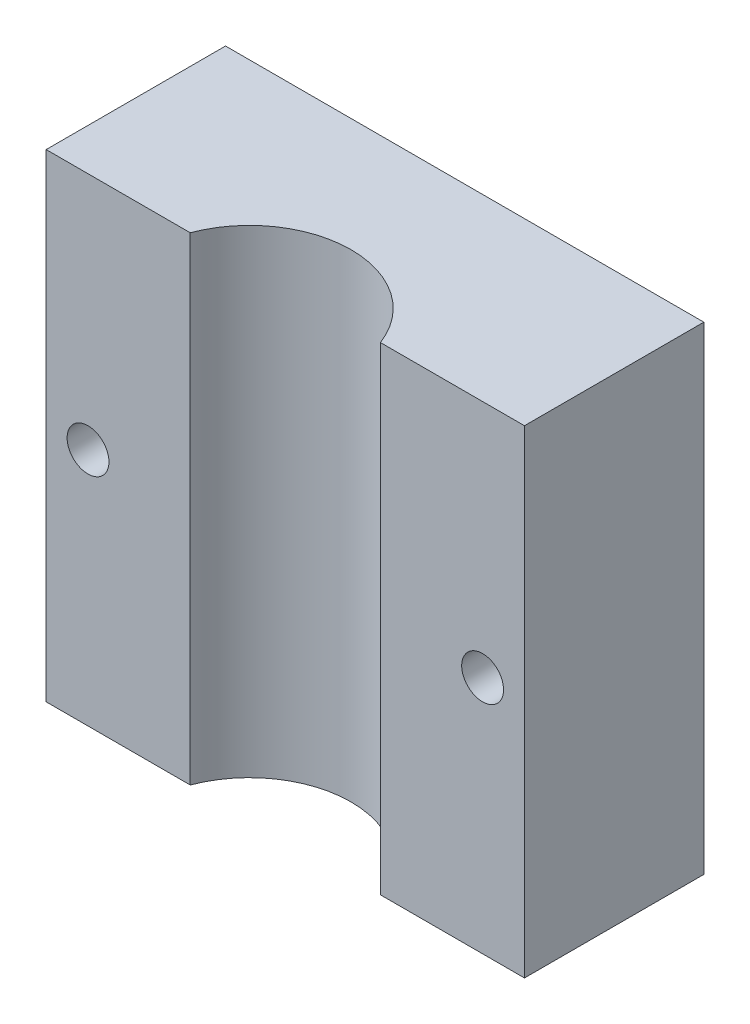
ISO-10303-21;
HEADER;
FILE_DESCRIPTION(('STEP AP214'),'2;1');
FILE_NAME('part.step','',(''),(''),'','','');
FILE_SCHEMA(('AUTOMOTIVE_DESIGN { 1 0 10303 214 1 1 1 1 }'));
ENDSEC;
DATA;
#1=APPLICATION_CONTEXT('core data for automotive mechanical design processes');
#2=APPLICATION_PROTOCOL_DEFINITION('international standard','automotive_design',2000,#1);
#3=PRODUCT_CONTEXT('',#1,'mechanical');
#4=PRODUCT('Part','Part','',(#3));
#5=PRODUCT_RELATED_PRODUCT_CATEGORY('part','',(#4));
#6=PRODUCT_DEFINITION_FORMATION('','',#4);
#7=PRODUCT_DEFINITION_CONTEXT('part definition',#1,'design');
#8=PRODUCT_DEFINITION('design','',#6,#7);
#9=PRODUCT_DEFINITION_SHAPE('','',#8);
#10=(LENGTH_UNIT() NAMED_UNIT(*) SI_UNIT(.MILLI.,.METRE.));
#11=(NAMED_UNIT(*) PLANE_ANGLE_UNIT() SI_UNIT($,.RADIAN.));
#12=(NAMED_UNIT(*) SI_UNIT($,.STERADIAN.) SOLID_ANGLE_UNIT());
#13=UNCERTAINTY_MEASURE_WITH_UNIT(LENGTH_MEASURE(1.E-05),#10,'distance_accuracy_value','');
#14=(GEOMETRIC_REPRESENTATION_CONTEXT(3) GLOBAL_UNCERTAINTY_ASSIGNED_CONTEXT((#13)) GLOBAL_UNIT_ASSIGNED_CONTEXT((#10,
#11,#12)) REPRESENTATION_CONTEXT('',''));
#15=CARTESIAN_POINT('',(0.,0.,0.));
#16=DIRECTION('',(0.,0.,1.));
#17=DIRECTION('',(1.,0.,0.));
#18=AXIS2_PLACEMENT_3D('',#15,#16,#17);
#19=CARTESIAN_POINT('',(0.,0.,15.));
#20=DIRECTION('',(0.,0.,1.));
#21=DIRECTION('',(1.,0.,0.));
#22=AXIS2_PLACEMENT_3D('',#19,#20,#21);
#23=PLANE('',#22);
#24=DIRECTION('',(0.,1.,0.));
#25=VECTOR('',#24,1.);
#26=CARTESIAN_POINT('',(7.95298686029344,-20.,15.));
#27=LINE('',#26,#25);
#28=CARTESIAN_POINT('',(7.95298686029344,-20.,15.));
#29=VERTEX_POINT('',#28);
#30=CARTESIAN_POINT('',(7.95298686029344,20.,15.));
#31=VERTEX_POINT('',#30);
#32=EDGE_CURVE('E11',#29,#31,#27,.T.);
#33=ORIENTED_EDGE('',*,*,#32,.F.);
#34=DIRECTION('',(1.,0.,0.));
#35=VECTOR('',#34,1.);
#36=CARTESIAN_POINT('',(-20.,-20.,15.));
#37=LINE('',#36,#35);
#38=CARTESIAN_POINT('',(20.,-20.,15.));
#39=VERTEX_POINT('',#38);
#40=EDGE_CURVE('E56',#29,#39,#37,.T.);
#41=ORIENTED_EDGE('',*,*,#40,.T.);
#42=DIRECTION('',(0.,1.,0.));
#43=VECTOR('',#42,1.);
#44=CARTESIAN_POINT('',(20.,20.,15.));
#45=LINE('',#44,#43);
#46=CARTESIAN_POINT('',(20.,20.,15.));
#47=VERTEX_POINT('',#46);
#48=EDGE_CURVE('E103',#39,#47,#45,.T.);
#49=ORIENTED_EDGE('',*,*,#48,.T.);
#50=DIRECTION('',(-1.,0.,0.));
#51=VECTOR('',#50,1.);
#52=CARTESIAN_POINT('',(-20.,20.,15.));
#53=LINE('',#52,#51);
#54=EDGE_CURVE('E85',#47,#31,#53,.T.);
#55=ORIENTED_EDGE('',*,*,#54,.T.);
#56=EDGE_LOOP('',(#33,#41,#49,#55));
#57=FACE_BOUND('',#56,.T.);
#58=CARTESIAN_POINT('',(16.5,0.,15.));
#59=DIRECTION('',(0.,0.,1.));
#60=DIRECTION('',(1.,0.,0.));
#61=AXIS2_PLACEMENT_3D('',#58,#59,#60);
#62=CIRCLE('',#61,1.75);
#63=CARTESIAN_POINT('',(18.25,0.,15.));
#64=VERTEX_POINT('',#63);
#65=EDGE_CURVE('E134',#64,#64,#62,.T.);
#66=ORIENTED_EDGE('',*,*,#65,.F.);
#67=EDGE_LOOP('',(#66));
#68=FACE_BOUND('',#67,.T.);
#69=ADVANCED_FACE('F33',(#57,#68),#23,.T.);
#70=CARTESIAN_POINT('',(20.,20.,15.));
#71=DIRECTION('',(-1.,0.,0.));
#72=DIRECTION('',(0.,0.,1.));
#73=AXIS2_PLACEMENT_3D('',#70,#71,#72);
#74=PLANE('',#73);
#75=DIRECTION('',(0.,1.,0.));
#76=VECTOR('',#75,1.);
#77=CARTESIAN_POINT('',(20.,20.,0.));
#78=LINE('',#77,#76);
#79=CARTESIAN_POINT('',(20.,-20.,0.));
#80=VERTEX_POINT('',#79);
#81=CARTESIAN_POINT('',(20.,20.,0.));
#82=VERTEX_POINT('',#81);
#83=EDGE_CURVE('E115',#80,#82,#78,.T.);
#84=ORIENTED_EDGE('',*,*,#83,.T.);
#85=DIRECTION('',(0.,0.,-1.));
#86=VECTOR('',#85,1.);
#87=CARTESIAN_POINT('',(20.,20.,15.));
#88=LINE('',#87,#86);
#89=EDGE_CURVE('E130',#47,#82,#88,.T.);
#90=ORIENTED_EDGE('',*,*,#89,.F.);
#91=ORIENTED_EDGE('',*,*,#48,.F.);
#92=DIRECTION('',(0.,0.,-1.));
#93=VECTOR('',#92,1.);
#94=CARTESIAN_POINT('',(20.,-20.,15.));
#95=LINE('',#94,#93);
#96=EDGE_CURVE('E114',#39,#80,#95,.T.);
#97=ORIENTED_EDGE('',*,*,#96,.T.);
#98=EDGE_LOOP('',(#84,#90,#91,#97));
#99=FACE_BOUND('',#98,.T.);
#100=ADVANCED_FACE('F35',(#99),#74,.F.);
#101=CARTESIAN_POINT('',(-20.,20.,15.));
#102=DIRECTION('',(0.,-1.,0.));
#103=DIRECTION('',(0.,0.,-1.));
#104=AXIS2_PLACEMENT_3D('',#101,#102,#103);
#105=PLANE('',#104);
#106=CARTESIAN_POINT('',(-7.95298686029344,20.,15.));
#107=VERTEX_POINT('',#106);
#108=CARTESIAN_POINT('',(-20.,20.,15.));
#109=VERTEX_POINT('',#108);
#110=EDGE_CURVE('E99',#107,#109,#53,.T.);
#111=ORIENTED_EDGE('',*,*,#110,.F.);
#112=CARTESIAN_POINT('',(0.,20.,18.));
#113=DIRECTION('',(0.,1.,0.));
#114=DIRECTION('',(0.,0.,1.));
#115=AXIS2_PLACEMENT_3D('',#112,#113,#114);
#116=CIRCLE('',#115,8.5);
#117=EDGE_CURVE('E47',#31,#107,#116,.T.);
#118=ORIENTED_EDGE('',*,*,#117,.F.);
#119=ORIENTED_EDGE('',*,*,#54,.F.);
#120=ORIENTED_EDGE('',*,*,#89,.T.);
#121=DIRECTION('',(-1.,0.,0.));
#122=VECTOR('',#121,1.);
#123=CARTESIAN_POINT('',(-20.,20.,0.));
#124=LINE('',#123,#122);
#125=CARTESIAN_POINT('',(-20.,20.,0.));
#126=VERTEX_POINT('',#125);
#127=EDGE_CURVE('E118',#82,#126,#124,.T.);
#128=ORIENTED_EDGE('',*,*,#127,.T.);
#129=DIRECTION('',(0.,0.,-1.));
#130=VECTOR('',#129,1.);
#131=CARTESIAN_POINT('',(-20.,20.,15.));
#132=LINE('',#131,#130);
#133=EDGE_CURVE('E127',#109,#126,#132,.T.);
#134=ORIENTED_EDGE('',*,*,#133,.F.);
#135=EDGE_LOOP('',(#111,#118,#119,#120,#128,#134));
#136=FACE_BOUND('',#135,.T.);
#137=ADVANCED_FACE('F97',(#136),#105,.F.);
#138=CARTESIAN_POINT('',(-20.,20.,15.));
#139=DIRECTION('',(1.,0.,0.));
#140=DIRECTION('',(0.,1.,0.));
#141=AXIS2_PLACEMENT_3D('',#138,#139,#140);
#142=PLANE('',#141);
#143=DIRECTION('',(0.,-1.,0.));
#144=VECTOR('',#143,1.);
#145=CARTESIAN_POINT('',(-20.,20.,0.));
#146=LINE('',#145,#144);
#147=CARTESIAN_POINT('',(-20.,-20.,0.));
#148=VERTEX_POINT('',#147);
#149=EDGE_CURVE('E121',#126,#148,#146,.T.);
#150=ORIENTED_EDGE('',*,*,#149,.T.);
#151=DIRECTION('',(0.,0.,-1.));
#152=VECTOR('',#151,1.);
#153=CARTESIAN_POINT('',(-20.,-20.,15.));
#154=LINE('',#153,#152);
#155=CARTESIAN_POINT('',(-20.,-20.,15.));
#156=VERTEX_POINT('',#155);
#157=EDGE_CURVE('E125',#156,#148,#154,.T.);
#158=ORIENTED_EDGE('',*,*,#157,.F.);
#159=DIRECTION('',(0.,-1.,0.));
#160=VECTOR('',#159,1.);
#161=CARTESIAN_POINT('',(-20.,20.,15.));
#162=LINE('',#161,#160);
#163=EDGE_CURVE('E105',#109,#156,#162,.T.);
#164=ORIENTED_EDGE('',*,*,#163,.F.);
#165=ORIENTED_EDGE('',*,*,#133,.T.);
#166=EDGE_LOOP('',(#150,#158,#164,#165));
#167=FACE_BOUND('',#166,.T.);
#168=ADVANCED_FACE('F141',(#167),#142,.F.);
#169=CARTESIAN_POINT('',(-20.,-20.,15.));
#170=DIRECTION('',(0.,1.,0.));
#171=DIRECTION('',(0.,0.,1.));
#172=AXIS2_PLACEMENT_3D('',#169,#170,#171);
#173=PLANE('',#172);
#174=ORIENTED_EDGE('',*,*,#40,.F.);
#175=CARTESIAN_POINT('',(0.,-20.,18.));
#176=DIRECTION('',(0.,1.,0.));
#177=DIRECTION('',(0.,0.,1.));
#178=AXIS2_PLACEMENT_3D('',#175,#176,#177);
#179=CIRCLE('',#178,8.5);
#180=CARTESIAN_POINT('',(-7.95298686029344,-20.,15.));
#181=VERTEX_POINT('',#180);
#182=EDGE_CURVE('E95',#29,#181,#179,.T.);
#183=ORIENTED_EDGE('',*,*,#182,.T.);
#184=EDGE_CURVE('E111',#156,#181,#37,.T.);
#185=ORIENTED_EDGE('',*,*,#184,.F.);
#186=ORIENTED_EDGE('',*,*,#157,.T.);
#187=DIRECTION('',(1.,0.,0.));
#188=VECTOR('',#187,1.);
#189=CARTESIAN_POINT('',(-20.,-20.,0.));
#190=LINE('',#189,#188);
#191=EDGE_CURVE('E78',#148,#80,#190,.T.);
#192=ORIENTED_EDGE('',*,*,#191,.T.);
#193=ORIENTED_EDGE('',*,*,#96,.F.);
#194=EDGE_LOOP('',(#174,#183,#185,#186,#192,#193));
#195=FACE_BOUND('',#194,.T.);
#196=ADVANCED_FACE('F133',(#195),#173,.F.);
#197=DIRECTION('',(0.,1.,0.));
#198=VECTOR('',#197,1.);
#199=CARTESIAN_POINT('',(-7.95298686029344,-20.,15.));
#200=LINE('',#199,#198);
#201=EDGE_CURVE('E41',#107,#181,#200,.F.);
#202=ORIENTED_EDGE('',*,*,#201,.F.);
#203=ORIENTED_EDGE('',*,*,#110,.T.);
#204=ORIENTED_EDGE('',*,*,#163,.T.);
#205=ORIENTED_EDGE('',*,*,#184,.T.);
#206=EDGE_LOOP('',(#202,#203,#204,#205));
#207=FACE_BOUND('',#206,.T.);
#208=CARTESIAN_POINT('',(-16.5,0.,15.));
#209=DIRECTION('',(0.,0.,1.));
#210=DIRECTION('',(1.,0.,0.));
#211=AXIS2_PLACEMENT_3D('',#208,#209,#210);
#212=CIRCLE('',#211,1.75);
#213=CARTESIAN_POINT('',(-14.75,0.,15.));
#214=VERTEX_POINT('',#213);
#215=EDGE_CURVE('E229',#214,#214,#212,.T.);
#216=ORIENTED_EDGE('',*,*,#215,.F.);
#217=EDGE_LOOP('',(#216));
#218=FACE_BOUND('',#217,.T.);
#219=ADVANCED_FACE('F136',(#207,#218),#23,.T.);
#220=CARTESIAN_POINT('',(0.,0.,0.));
#221=DIRECTION('',(0.,0.,1.));
#222=DIRECTION('',(1.,0.,0.));
#223=AXIS2_PLACEMENT_3D('',#220,#221,#222);
#224=PLANE('',#223);
#225=CARTESIAN_POINT('',(16.5,0.,0.));
#226=DIRECTION('',(0.,0.,1.));
#227=DIRECTION('',(1.,0.,0.));
#228=AXIS2_PLACEMENT_3D('',#225,#226,#227);
#229=CIRCLE('',#228,1.75);
#230=CARTESIAN_POINT('',(18.25,0.,0.));
#231=VERTEX_POINT('',#230);
#232=EDGE_CURVE('E230',#231,#231,#229,.T.);
#233=ORIENTED_EDGE('',*,*,#232,.T.);
#234=EDGE_LOOP('',(#233));
#235=FACE_BOUND('',#234,.T.);
#236=CARTESIAN_POINT('',(-16.5,0.,0.));
#237=DIRECTION('',(0.,0.,1.));
#238=DIRECTION('',(1.,0.,0.));
#239=AXIS2_PLACEMENT_3D('',#236,#237,#238);
#240=CIRCLE('',#239,1.75);
#241=CARTESIAN_POINT('',(-14.75,0.,0.));
#242=VERTEX_POINT('',#241);
#243=EDGE_CURVE('E119',#242,#242,#240,.T.);
#244=ORIENTED_EDGE('',*,*,#243,.T.);
#245=EDGE_LOOP('',(#244));
#246=FACE_BOUND('',#245,.T.);
#247=ORIENTED_EDGE('',*,*,#83,.F.);
#248=ORIENTED_EDGE('',*,*,#191,.F.);
#249=ORIENTED_EDGE('',*,*,#149,.F.);
#250=ORIENTED_EDGE('',*,*,#127,.F.);
#251=EDGE_LOOP('',(#247,#248,#249,#250));
#252=FACE_BOUND('',#251,.T.);
#253=ADVANCED_FACE('F145',(#235,#246,#252),#224,.F.);
#254=CARTESIAN_POINT('',(-16.5,0.,0.));
#255=DIRECTION('',(0.,0.,1.));
#256=DIRECTION('',(1.,0.,0.));
#257=AXIS2_PLACEMENT_3D('',#254,#255,#256);
#258=CYLINDRICAL_SURFACE('',#257,1.75);
#259=ORIENTED_EDGE('',*,*,#243,.F.);
#260=EDGE_LOOP('',(#259));
#261=FACE_BOUND('',#260,.T.);
#262=ORIENTED_EDGE('',*,*,#215,.T.);
#263=EDGE_LOOP('',(#262));
#264=FACE_BOUND('',#263,.T.);
#265=ADVANCED_FACE('F162',(#261,#264),#258,.F.);
#266=CARTESIAN_POINT('',(16.5,0.,0.));
#267=DIRECTION('',(0.,0.,1.));
#268=DIRECTION('',(1.,0.,0.));
#269=AXIS2_PLACEMENT_3D('',#266,#267,#268);
#270=CYLINDRICAL_SURFACE('',#269,1.75);
#271=ORIENTED_EDGE('',*,*,#232,.F.);
#272=EDGE_LOOP('',(#271));
#273=FACE_BOUND('',#272,.T.);
#274=ORIENTED_EDGE('',*,*,#65,.T.);
#275=EDGE_LOOP('',(#274));
#276=FACE_BOUND('',#275,.T.);
#277=ADVANCED_FACE('F197',(#273,#276),#270,.F.);
#278=CARTESIAN_POINT('',(0.,-20.,18.));
#279=DIRECTION('',(0.,1.,0.));
#280=DIRECTION('',(0.,0.,1.));
#281=AXIS2_PLACEMENT_3D('',#278,#279,#280);
#282=CYLINDRICAL_SURFACE('',#281,8.5);
#283=ORIENTED_EDGE('',*,*,#32,.T.);
#284=ORIENTED_EDGE('',*,*,#117,.T.);
#285=ORIENTED_EDGE('',*,*,#201,.T.);
#286=ORIENTED_EDGE('',*,*,#182,.F.);
#287=EDGE_LOOP('',(#283,#284,#285,#286));
#288=FACE_BOUND('',#287,.T.);
#289=ADVANCED_FACE('F93',(#288),#282,.F.);
#290=CLOSED_SHELL('',(#69,#100,#137,#168,#196,#219,#253,#265,#277,#289));
#291=MANIFOLD_SOLID_BREP('B2',#290);
#292=ADVANCED_BREP_SHAPE_REPRESENTATION('',(#18,#291),#14);
#293=SHAPE_DEFINITION_REPRESENTATION(#9,#292);
ENDSEC;
END-ISO-10303-21;
